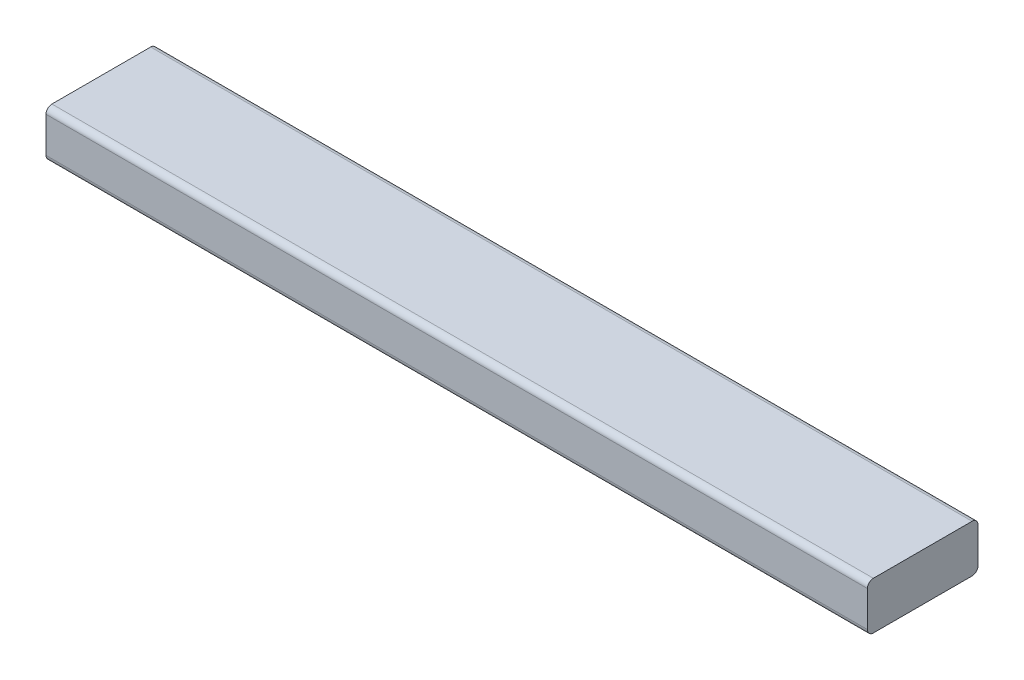
ISO-10303-21;
HEADER;
FILE_DESCRIPTION(('STEP AP214'),'2;1');
FILE_NAME('part.step','',(''),(''),'','','');
FILE_SCHEMA(('AUTOMOTIVE_DESIGN { 1 0 10303 214 1 1 1 1 }'));
ENDSEC;
DATA;
#1=APPLICATION_CONTEXT('core data for automotive mechanical design processes');
#2=APPLICATION_PROTOCOL_DEFINITION('international standard','automotive_design',2000,#1);
#3=PRODUCT_CONTEXT('',#1,'mechanical');
#4=PRODUCT('Part','Part','',(#3));
#5=PRODUCT_RELATED_PRODUCT_CATEGORY('part','',(#4));
#6=PRODUCT_DEFINITION_FORMATION('','',#4);
#7=PRODUCT_DEFINITION_CONTEXT('part definition',#1,'design');
#8=PRODUCT_DEFINITION('design','',#6,#7);
#9=PRODUCT_DEFINITION_SHAPE('','',#8);
#10=(LENGTH_UNIT() NAMED_UNIT(*) SI_UNIT(.MILLI.,.METRE.));
#11=(NAMED_UNIT(*) PLANE_ANGLE_UNIT() SI_UNIT($,.RADIAN.));
#12=(NAMED_UNIT(*) SI_UNIT($,.STERADIAN.) SOLID_ANGLE_UNIT());
#13=UNCERTAINTY_MEASURE_WITH_UNIT(LENGTH_MEASURE(1.E-05),#10,'distance_accuracy_value','');
#14=(GEOMETRIC_REPRESENTATION_CONTEXT(3) GLOBAL_UNCERTAINTY_ASSIGNED_CONTEXT((#13)) GLOBAL_UNIT_ASSIGNED_CONTEXT((#10,
#11,#12)) REPRESENTATION_CONTEXT('',''));
#15=CARTESIAN_POINT('',(0.,0.,0.));
#16=DIRECTION('',(0.,0.,1.));
#17=DIRECTION('',(1.,0.,0.));
#18=AXIS2_PLACEMENT_3D('',#15,#16,#17);
#19=CARTESIAN_POINT('',(330.2,38.1,44.45));
#20=DIRECTION('',(-1.,0.,0.));
#21=DIRECTION('',(0.,0.,1.));
#22=AXIS2_PLACEMENT_3D('',#19,#20,#21);
#23=PLANE('',#22);
#24=DIRECTION('',(0.,0.,-1.));
#25=VECTOR('',#24,1.);
#26=CARTESIAN_POINT('',(330.2,0.,44.45));
#27=LINE('',#26,#25);
#28=CARTESIAN_POINT('',(330.2,0.,39.6875));
#29=VERTEX_POINT('',#28);
#30=CARTESIAN_POINT('',(330.2,0.,-39.6875));
#31=VERTEX_POINT('',#30);
#32=EDGE_CURVE('E166',#29,#31,#27,.T.);
#33=ORIENTED_EDGE('',*,*,#32,.T.);
#34=CARTESIAN_POINT('',(330.2,4.7625,-39.6875));
#35=DIRECTION('',(-1.,0.,0.));
#36=DIRECTION('',(0.,0.,1.));
#37=AXIS2_PLACEMENT_3D('',#34,#35,#36);
#38=CIRCLE('',#37,4.7625);
#39=CARTESIAN_POINT('',(330.2,4.76250000000002,-44.45));
#40=VERTEX_POINT('',#39);
#41=EDGE_CURVE('E140',#31,#40,#38,.F.);
#42=ORIENTED_EDGE('',*,*,#41,.T.);
#43=DIRECTION('',(0.,-1.,0.));
#44=VECTOR('',#43,1.);
#45=CARTESIAN_POINT('',(330.2,38.1,-44.45));
#46=LINE('',#45,#44);
#47=CARTESIAN_POINT('',(330.2,33.3375,-44.45));
#48=VERTEX_POINT('',#47);
#49=EDGE_CURVE('E119',#48,#40,#46,.T.);
#50=ORIENTED_EDGE('',*,*,#49,.F.);
#51=CARTESIAN_POINT('',(330.2,33.3375,-39.6875));
#52=DIRECTION('',(-1.,0.,0.));
#53=DIRECTION('',(0.,0.,1.));
#54=AXIS2_PLACEMENT_3D('',#51,#52,#53);
#55=CIRCLE('',#54,4.7625);
#56=CARTESIAN_POINT('',(330.2,38.1,-39.6875));
#57=VERTEX_POINT('',#56);
#58=EDGE_CURVE('E124',#48,#57,#55,.F.);
#59=ORIENTED_EDGE('',*,*,#58,.T.);
#60=DIRECTION('',(0.,0.,-1.));
#61=VECTOR('',#60,1.);
#62=CARTESIAN_POINT('',(330.2,38.1,44.45));
#63=LINE('',#62,#61);
#64=CARTESIAN_POINT('',(330.2,38.1,39.6875));
#65=VERTEX_POINT('',#64);
#66=EDGE_CURVE('E161',#65,#57,#63,.T.);
#67=ORIENTED_EDGE('',*,*,#66,.F.);
#68=CARTESIAN_POINT('',(330.2,33.3375,39.6875));
#69=DIRECTION('',(-1.,0.,0.));
#70=DIRECTION('',(0.,0.,1.));
#71=AXIS2_PLACEMENT_3D('',#68,#69,#70);
#72=CIRCLE('',#71,4.7625);
#73=CARTESIAN_POINT('',(330.2,33.3375,44.45));
#74=VERTEX_POINT('',#73);
#75=EDGE_CURVE('E54',#65,#74,#72,.F.);
#76=ORIENTED_EDGE('',*,*,#75,.T.);
#77=DIRECTION('',(0.,-1.,0.));
#78=VECTOR('',#77,1.);
#79=CARTESIAN_POINT('',(330.2,38.1,44.45));
#80=LINE('',#79,#78);
#81=CARTESIAN_POINT('',(330.2,4.76250000000002,44.45));
#82=VERTEX_POINT('',#81);
#83=EDGE_CURVE('E151',#74,#82,#80,.T.);
#84=ORIENTED_EDGE('',*,*,#83,.T.);
#85=CARTESIAN_POINT('',(330.2,4.7625,39.6875));
#86=DIRECTION('',(-1.,0.,0.));
#87=DIRECTION('',(0.,0.,1.));
#88=AXIS2_PLACEMENT_3D('',#85,#86,#87);
#89=CIRCLE('',#88,4.7625);
#90=EDGE_CURVE('E47',#82,#29,#89,.F.);
#91=ORIENTED_EDGE('',*,*,#90,.T.);
#92=EDGE_LOOP('',(#33,#42,#50,#59,#67,#76,#84,#91));
#93=FACE_BOUND('',#92,.T.);
#94=ADVANCED_FACE('F32',(#93),#23,.F.);
#95=CARTESIAN_POINT('',(-330.2,38.1,-44.45));
#96=DIRECTION('',(0.,0.,1.));
#97=DIRECTION('',(1.,0.,0.));
#98=AXIS2_PLACEMENT_3D('',#95,#96,#97);
#99=PLANE('',#98);
#100=ORIENTED_EDGE('',*,*,#49,.T.);
#101=DIRECTION('',(-1.,0.,0.));
#102=VECTOR('',#101,1.);
#103=CARTESIAN_POINT('',(-330.2,4.7625,-44.45));
#104=LINE('',#103,#102);
#105=CARTESIAN_POINT('',(-330.2,4.76250000000002,-44.45));
#106=VERTEX_POINT('',#105);
#107=EDGE_CURVE('E118',#40,#106,#104,.T.);
#108=ORIENTED_EDGE('',*,*,#107,.T.);
#109=DIRECTION('',(0.,-1.,0.));
#110=VECTOR('',#109,1.);
#111=CARTESIAN_POINT('',(-330.2,38.1,-44.45));
#112=LINE('',#111,#110);
#113=CARTESIAN_POINT('',(-330.2,33.3375,-44.45));
#114=VERTEX_POINT('',#113);
#115=EDGE_CURVE('E101',#114,#106,#112,.T.);
#116=ORIENTED_EDGE('',*,*,#115,.F.);
#117=DIRECTION('',(-1.,0.,0.));
#118=VECTOR('',#117,1.);
#119=CARTESIAN_POINT('',(-330.2,33.3375,-44.45));
#120=LINE('',#119,#118);
#121=EDGE_CURVE('E115',#114,#48,#120,.F.);
#122=ORIENTED_EDGE('',*,*,#121,.T.);
#123=EDGE_LOOP('',(#100,#108,#116,#122));
#124=FACE_BOUND('',#123,.T.);
#125=ADVANCED_FACE('F114',(#124),#99,.F.);
#126=CARTESIAN_POINT('',(-330.2,38.1,44.45));
#127=DIRECTION('',(1.,0.,0.));
#128=DIRECTION('',(0.,0.,-1.));
#129=AXIS2_PLACEMENT_3D('',#126,#127,#128);
#130=PLANE('',#129);
#131=ORIENTED_EDGE('',*,*,#115,.T.);
#132=CARTESIAN_POINT('',(-330.2,4.7625,-39.6875));
#133=DIRECTION('',(1.,0.,0.));
#134=DIRECTION('',(0.,0.,-1.));
#135=AXIS2_PLACEMENT_3D('',#132,#133,#134);
#136=CIRCLE('',#135,4.7625);
#137=CARTESIAN_POINT('',(-330.2,0.,-39.6875));
#138=VERTEX_POINT('',#137);
#139=EDGE_CURVE('E108',#106,#138,#136,.F.);
#140=ORIENTED_EDGE('',*,*,#139,.T.);
#141=DIRECTION('',(0.,0.,1.));
#142=VECTOR('',#141,1.);
#143=CARTESIAN_POINT('',(-330.2,0.,44.45));
#144=LINE('',#143,#142);
#145=CARTESIAN_POINT('',(-330.2,0.,39.6875));
#146=VERTEX_POINT('',#145);
#147=EDGE_CURVE('E163',#138,#146,#144,.T.);
#148=ORIENTED_EDGE('',*,*,#147,.T.);
#149=CARTESIAN_POINT('',(-330.2,4.7625,39.6875));
#150=DIRECTION('',(1.,0.,0.));
#151=DIRECTION('',(0.,0.,-1.));
#152=AXIS2_PLACEMENT_3D('',#149,#150,#151);
#153=CIRCLE('',#152,4.7625);
#154=CARTESIAN_POINT('',(-330.2,4.76250000000002,44.45));
#155=VERTEX_POINT('',#154);
#156=EDGE_CURVE('E109',#146,#155,#153,.F.);
#157=ORIENTED_EDGE('',*,*,#156,.T.);
#158=DIRECTION('',(0.,-1.,0.));
#159=VECTOR('',#158,1.);
#160=CARTESIAN_POINT('',(-330.2,38.1,44.45));
#161=LINE('',#160,#159);
#162=CARTESIAN_POINT('',(-330.2,33.3375,44.45));
#163=VERTEX_POINT('',#162);
#164=EDGE_CURVE('E120',#163,#155,#161,.T.);
#165=ORIENTED_EDGE('',*,*,#164,.F.);
#166=CARTESIAN_POINT('',(-330.2,33.3375,39.6875));
#167=DIRECTION('',(1.,0.,0.));
#168=DIRECTION('',(0.,0.,-1.));
#169=AXIS2_PLACEMENT_3D('',#166,#167,#168);
#170=CIRCLE('',#169,4.7625);
#171=CARTESIAN_POINT('',(-330.2,38.1,39.6875));
#172=VERTEX_POINT('',#171);
#173=EDGE_CURVE('E126',#163,#172,#170,.F.);
#174=ORIENTED_EDGE('',*,*,#173,.T.);
#175=DIRECTION('',(0.,0.,1.));
#176=VECTOR('',#175,1.);
#177=CARTESIAN_POINT('',(-330.2,38.1,44.45));
#178=LINE('',#177,#176);
#179=CARTESIAN_POINT('',(-330.2,38.1,-39.6875));
#180=VERTEX_POINT('',#179);
#181=EDGE_CURVE('E103',#180,#172,#178,.T.);
#182=ORIENTED_EDGE('',*,*,#181,.F.);
#183=CARTESIAN_POINT('',(-330.2,33.3375,-39.6875));
#184=DIRECTION('',(1.,0.,0.));
#185=DIRECTION('',(0.,0.,-1.));
#186=AXIS2_PLACEMENT_3D('',#183,#184,#185);
#187=CIRCLE('',#186,4.7625);
#188=EDGE_CURVE('E98',#180,#114,#187,.F.);
#189=ORIENTED_EDGE('',*,*,#188,.T.);
#190=EDGE_LOOP('',(#131,#140,#148,#157,#165,#174,#182,#189));
#191=FACE_BOUND('',#190,.T.);
#192=ADVANCED_FACE('F100',(#191),#130,.F.);
#193=CARTESIAN_POINT('',(-330.2,38.1,44.45));
#194=DIRECTION('',(0.,0.,-1.));
#195=DIRECTION('',(-1.,0.,0.));
#196=AXIS2_PLACEMENT_3D('',#193,#194,#195);
#197=PLANE('',#196);
#198=ORIENTED_EDGE('',*,*,#164,.T.);
#199=DIRECTION('',(1.,0.,0.));
#200=VECTOR('',#199,1.);
#201=CARTESIAN_POINT('',(330.2,4.7625,44.45));
#202=LINE('',#201,#200);
#203=EDGE_CURVE('E11',#155,#82,#202,.T.);
#204=ORIENTED_EDGE('',*,*,#203,.T.);
#205=ORIENTED_EDGE('',*,*,#83,.F.);
#206=DIRECTION('',(1.,0.,0.));
#207=VECTOR('',#206,1.);
#208=CARTESIAN_POINT('',(-330.2,33.3375,44.45));
#209=LINE('',#208,#207);
#210=EDGE_CURVE('E40',#74,#163,#209,.F.);
#211=ORIENTED_EDGE('',*,*,#210,.T.);
#212=EDGE_LOOP('',(#198,#204,#205,#211));
#213=FACE_BOUND('',#212,.T.);
#214=ADVANCED_FACE('F150',(#213),#197,.F.);
#215=CARTESIAN_POINT('',(0.,38.1,0.));
#216=DIRECTION('',(0.,-1.,0.));
#217=DIRECTION('',(0.,0.,-1.));
#218=AXIS2_PLACEMENT_3D('',#215,#216,#217);
#219=PLANE('',#218);
#220=ORIENTED_EDGE('',*,*,#66,.T.);
#221=DIRECTION('',(-1.,0.,0.));
#222=VECTOR('',#221,1.);
#223=CARTESIAN_POINT('',(0.,38.1,-39.6875));
#224=LINE('',#223,#222);
#225=EDGE_CURVE('E145',#57,#180,#224,.T.);
#226=ORIENTED_EDGE('',*,*,#225,.T.);
#227=ORIENTED_EDGE('',*,*,#181,.T.);
#228=DIRECTION('',(1.,0.,0.));
#229=VECTOR('',#228,1.);
#230=CARTESIAN_POINT('',(0.,38.1,39.6875));
#231=LINE('',#230,#229);
#232=EDGE_CURVE('E142',#172,#65,#231,.T.);
#233=ORIENTED_EDGE('',*,*,#232,.T.);
#234=EDGE_LOOP('',(#220,#226,#227,#233));
#235=FACE_BOUND('',#234,.T.);
#236=ADVANCED_FACE('F160',(#235),#219,.F.);
#237=CARTESIAN_POINT('',(0.,0.,0.));
#238=DIRECTION('',(0.,-1.,0.));
#239=DIRECTION('',(0.,0.,-1.));
#240=AXIS2_PLACEMENT_3D('',#237,#238,#239);
#241=PLANE('',#240);
#242=ORIENTED_EDGE('',*,*,#147,.F.);
#243=DIRECTION('',(-1.,0.,0.));
#244=VECTOR('',#243,1.);
#245=CARTESIAN_POINT('',(330.2,0.,-39.6875));
#246=LINE('',#245,#244);
#247=EDGE_CURVE('E135',#138,#31,#246,.F.);
#248=ORIENTED_EDGE('',*,*,#247,.T.);
#249=ORIENTED_EDGE('',*,*,#32,.F.);
#250=DIRECTION('',(1.,0.,0.));
#251=VECTOR('',#250,1.);
#252=CARTESIAN_POINT('',(-330.2,0.,39.6875));
#253=LINE('',#252,#251);
#254=EDGE_CURVE('E133',#29,#146,#253,.F.);
#255=ORIENTED_EDGE('',*,*,#254,.T.);
#256=EDGE_LOOP('',(#242,#248,#249,#255));
#257=FACE_BOUND('',#256,.T.);
#258=ADVANCED_FACE('F174',(#257),#241,.T.);
#259=CARTESIAN_POINT('',(-330.2,4.7625,-39.6875));
#260=DIRECTION('',(1.,0.,0.));
#261=DIRECTION('',(0.,0.,-1.));
#262=AXIS2_PLACEMENT_3D('',#259,#260,#261);
#263=CYLINDRICAL_SURFACE('',#262,4.7625);
#264=ORIENTED_EDGE('',*,*,#41,.F.);
#265=ORIENTED_EDGE('',*,*,#247,.F.);
#266=ORIENTED_EDGE('',*,*,#139,.F.);
#267=ORIENTED_EDGE('',*,*,#107,.F.);
#268=EDGE_LOOP('',(#264,#265,#266,#267));
#269=FACE_BOUND('',#268,.T.);
#270=ADVANCED_FACE('F182',(#269),#263,.T.);
#271=CARTESIAN_POINT('',(0.,33.3375,-39.6875));
#272=DIRECTION('',(-1.,0.,0.));
#273=DIRECTION('',(0.,0.,1.));
#274=AXIS2_PLACEMENT_3D('',#271,#272,#273);
#275=CYLINDRICAL_SURFACE('',#274,4.7625);
#276=ORIENTED_EDGE('',*,*,#58,.F.);
#277=ORIENTED_EDGE('',*,*,#121,.F.);
#278=ORIENTED_EDGE('',*,*,#188,.F.);
#279=ORIENTED_EDGE('',*,*,#225,.F.);
#280=EDGE_LOOP('',(#276,#277,#278,#279));
#281=FACE_BOUND('',#280,.T.);
#282=ADVANCED_FACE('F123',(#281),#275,.T.);
#283=CARTESIAN_POINT('',(-330.2,4.7625,39.6875));
#284=DIRECTION('',(-1.,0.,0.));
#285=DIRECTION('',(0.,0.,1.));
#286=AXIS2_PLACEMENT_3D('',#283,#284,#285);
#287=CYLINDRICAL_SURFACE('',#286,4.7625);
#288=ORIENTED_EDGE('',*,*,#156,.F.);
#289=ORIENTED_EDGE('',*,*,#254,.F.);
#290=ORIENTED_EDGE('',*,*,#90,.F.);
#291=ORIENTED_EDGE('',*,*,#203,.F.);
#292=EDGE_LOOP('',(#288,#289,#290,#291));
#293=FACE_BOUND('',#292,.T.);
#294=ADVANCED_FACE('F176',(#293),#287,.T.);
#295=CARTESIAN_POINT('',(0.,33.3375,39.6875));
#296=DIRECTION('',(1.,0.,0.));
#297=DIRECTION('',(0.,0.,-1.));
#298=AXIS2_PLACEMENT_3D('',#295,#296,#297);
#299=CYLINDRICAL_SURFACE('',#298,4.7625);
#300=ORIENTED_EDGE('',*,*,#173,.F.);
#301=ORIENTED_EDGE('',*,*,#210,.F.);
#302=ORIENTED_EDGE('',*,*,#75,.F.);
#303=ORIENTED_EDGE('',*,*,#232,.F.);
#304=EDGE_LOOP('',(#300,#301,#302,#303));
#305=FACE_BOUND('',#304,.T.);
#306=ADVANCED_FACE('F34',(#305),#299,.T.);
#307=CLOSED_SHELL('',(#94,#125,#192,#214,#236,#258,#270,#282,#294,#306));
#308=MANIFOLD_SOLID_BREP('B2',#307);
#309=ADVANCED_BREP_SHAPE_REPRESENTATION('',(#18,#308),#14);
#310=SHAPE_DEFINITION_REPRESENTATION(#9,#309);
ENDSEC;
END-ISO-10303-21;
